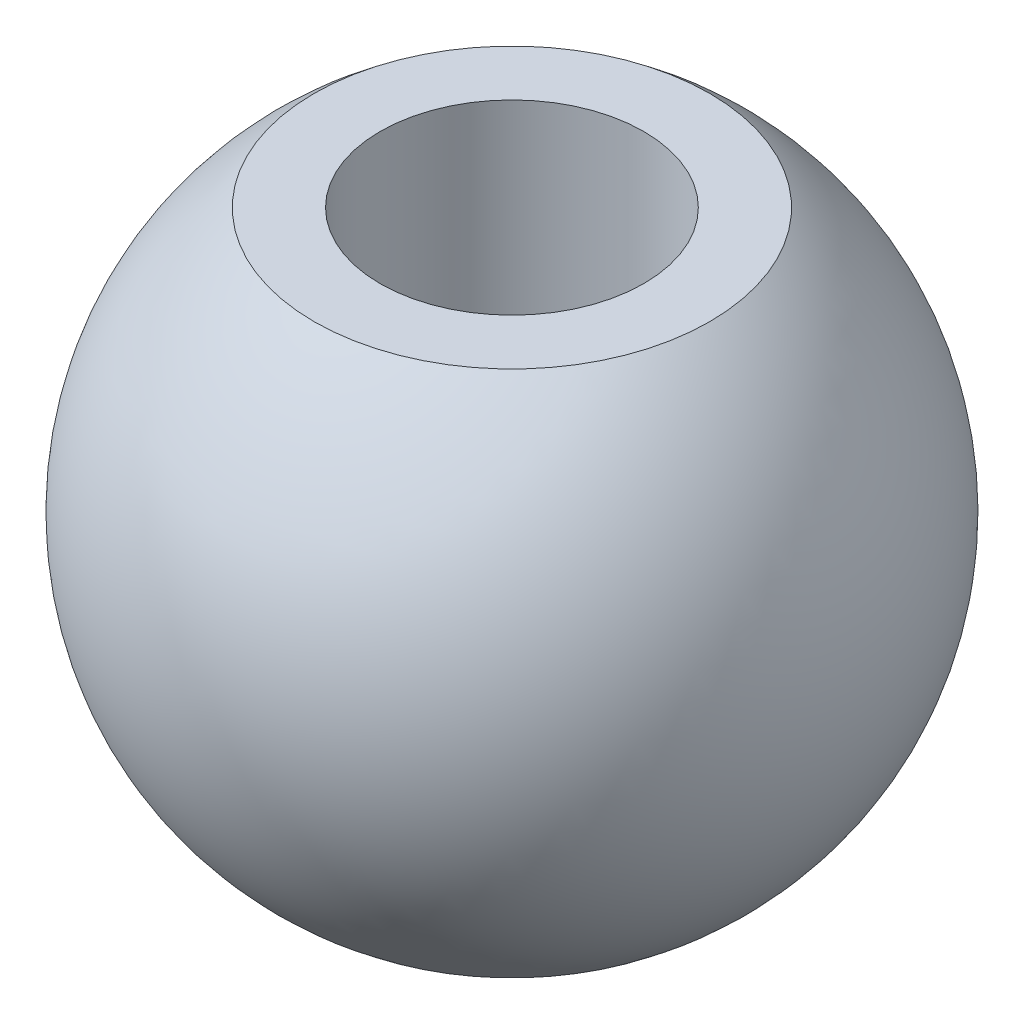
ISO-10303-21;
HEADER;
FILE_DESCRIPTION(('STEP AP214'),'2;1');
FILE_NAME('part.step','',(''),(''),'','','');
FILE_SCHEMA(('AUTOMOTIVE_DESIGN { 1 0 10303 214 1 1 1 1 }'));
ENDSEC;
DATA;
#1=APPLICATION_CONTEXT('core data for automotive mechanical design processes');
#2=APPLICATION_PROTOCOL_DEFINITION('international standard','automotive_design',2000,#1);
#3=PRODUCT_CONTEXT('',#1,'mechanical');
#4=PRODUCT('Part','Part','',(#3));
#5=PRODUCT_RELATED_PRODUCT_CATEGORY('part','',(#4));
#6=PRODUCT_DEFINITION_FORMATION('','',#4);
#7=PRODUCT_DEFINITION_CONTEXT('part definition',#1,'design');
#8=PRODUCT_DEFINITION('design','',#6,#7);
#9=PRODUCT_DEFINITION_SHAPE('','',#8);
#10=(LENGTH_UNIT() NAMED_UNIT(*) SI_UNIT(.MILLI.,.METRE.));
#11=(NAMED_UNIT(*) PLANE_ANGLE_UNIT() SI_UNIT($,.RADIAN.));
#12=(NAMED_UNIT(*) SI_UNIT($,.STERADIAN.) SOLID_ANGLE_UNIT());
#13=UNCERTAINTY_MEASURE_WITH_UNIT(LENGTH_MEASURE(1.E-05),#10,'distance_accuracy_value','');
#14=(GEOMETRIC_REPRESENTATION_CONTEXT(3) GLOBAL_UNCERTAINTY_ASSIGNED_CONTEXT((#13)) GLOBAL_UNIT_ASSIGNED_CONTEXT((#10,
#11,#12)) REPRESENTATION_CONTEXT('',''));
#15=CARTESIAN_POINT('',(0.,0.,0.));
#16=DIRECTION('',(0.,0.,1.));
#17=DIRECTION('',(1.,0.,0.));
#18=AXIS2_PLACEMENT_3D('',#15,#16,#17);
#19=CARTESIAN_POINT('',(0.,0.,0.));
#20=DIRECTION('',(0.,0.,-1.));
#21=DIRECTION('',(1.,0.,0.));
#22=AXIS2_PLACEMENT_3D('',#19,#20,#21);
#23=SPHERICAL_SURFACE('',#22,2.5);
#24=CARTESIAN_POINT('',(0.,0.,0.));
#25=DIRECTION('',(0.,1.,0.));
#26=DIRECTION('',(0.,0.,1.));
#27=AXIS2_PLACEMENT_3D('',#24,#25,#26);
#28=SPHERICAL_SURFACE('',#27,2.5);
#29=CARTESIAN_POINT('',(0.,-2.,0.));
#30=DIRECTION('',(0.,1.,0.));
#31=DIRECTION('',(0.,0.,1.));
#32=AXIS2_PLACEMENT_3D('',#29,#30,#31);
#33=CIRCLE('',#32,1.5);
#34=CARTESIAN_POINT('',(0.,-2.,1.5));
#35=VERTEX_POINT('',#34);
#36=EDGE_CURVE('E49',#35,#35,#33,.T.);
#37=ORIENTED_EDGE('',*,*,#36,.T.);
#38=EDGE_LOOP('',(#37));
#39=FACE_BOUND('',#38,.T.);
#40=CARTESIAN_POINT('',(0.,2.,0.));
#41=DIRECTION('',(0.,1.,0.));
#42=DIRECTION('',(0.,0.,1.));
#43=AXIS2_PLACEMENT_3D('',#40,#41,#42);
#44=CIRCLE('',#43,1.5);
#45=CARTESIAN_POINT('',(0.,2.,1.5));
#46=VERTEX_POINT('',#45);
#47=EDGE_CURVE('E10',#46,#46,#44,.T.);
#48=ORIENTED_EDGE('',*,*,#47,.F.);
#49=EDGE_LOOP('',(#48));
#50=FACE_BOUND('',#49,.T.);
#51=ADVANCED_FACE('F41',(#39,#50),#28,.T.);
#52=CARTESIAN_POINT('',(0.,-2.,10.));
#53=DIRECTION('',(0.,1.,0.));
#54=DIRECTION('',(0.,0.,1.));
#55=AXIS2_PLACEMENT_3D('',#52,#53,#54);
#56=PLANE('',#55);
#57=CARTESIAN_POINT('',(0.,-2.,0.));
#58=DIRECTION('',(0.,-1.,0.));
#59=DIRECTION('',(0.,0.,-1.));
#60=AXIS2_PLACEMENT_3D('',#57,#58,#59);
#61=CIRCLE('',#60,1.);
#62=CARTESIAN_POINT('',(0.,-2.,-1.));
#63=VERTEX_POINT('',#62);
#64=EDGE_CURVE('E56',#63,#63,#61,.T.);
#65=ORIENTED_EDGE('',*,*,#64,.F.);
#66=EDGE_LOOP('',(#65));
#67=FACE_BOUND('',#66,.T.);
#68=ORIENTED_EDGE('',*,*,#36,.F.);
#69=EDGE_LOOP('',(#68));
#70=FACE_BOUND('',#69,.T.);
#71=ADVANCED_FACE('F69',(#67,#70),#56,.F.);
#72=CARTESIAN_POINT('',(0.,2.,10.));
#73=DIRECTION('',(0.,1.,0.));
#74=DIRECTION('',(0.,0.,1.));
#75=AXIS2_PLACEMENT_3D('',#72,#73,#74);
#76=PLANE('',#75);
#77=CARTESIAN_POINT('',(0.,2.,0.));
#78=DIRECTION('',(0.,1.,0.));
#79=DIRECTION('',(0.,0.,1.));
#80=AXIS2_PLACEMENT_3D('',#77,#78,#79);
#81=CIRCLE('',#80,1.);
#82=CARTESIAN_POINT('',(0.,2.,1.));
#83=VERTEX_POINT('',#82);
#84=EDGE_CURVE('E44',#83,#83,#81,.T.);
#85=ORIENTED_EDGE('',*,*,#84,.F.);
#86=EDGE_LOOP('',(#85));
#87=FACE_BOUND('',#86,.T.);
#88=ORIENTED_EDGE('',*,*,#47,.T.);
#89=EDGE_LOOP('',(#88));
#90=FACE_BOUND('',#89,.T.);
#91=ADVANCED_FACE('F67',(#87,#90),#76,.T.);
#92=CARTESIAN_POINT('',(0.,8.,0.));
#93=DIRECTION('',(0.,-1.,0.));
#94=DIRECTION('',(0.,0.,-1.));
#95=AXIS2_PLACEMENT_3D('',#92,#93,#94);
#96=CYLINDRICAL_SURFACE('',#95,1.);
#97=ORIENTED_EDGE('',*,*,#84,.T.);
#98=EDGE_LOOP('',(#97));
#99=FACE_BOUND('',#98,.T.);
#100=ORIENTED_EDGE('',*,*,#64,.T.);
#101=EDGE_LOOP('',(#100));
#102=FACE_BOUND('',#101,.T.);
#103=ADVANCED_FACE('F65',(#99,#102),#96,.F.);
#104=CLOSED_SHELL('',(#51,#71,#91,#103));
#105=MANIFOLD_SOLID_BREP('B2',#104);
#106=ADVANCED_BREP_SHAPE_REPRESENTATION('',(#18,#105),#14);
#107=SHAPE_DEFINITION_REPRESENTATION(#9,#106);
ENDSEC;
END-ISO-10303-21;
